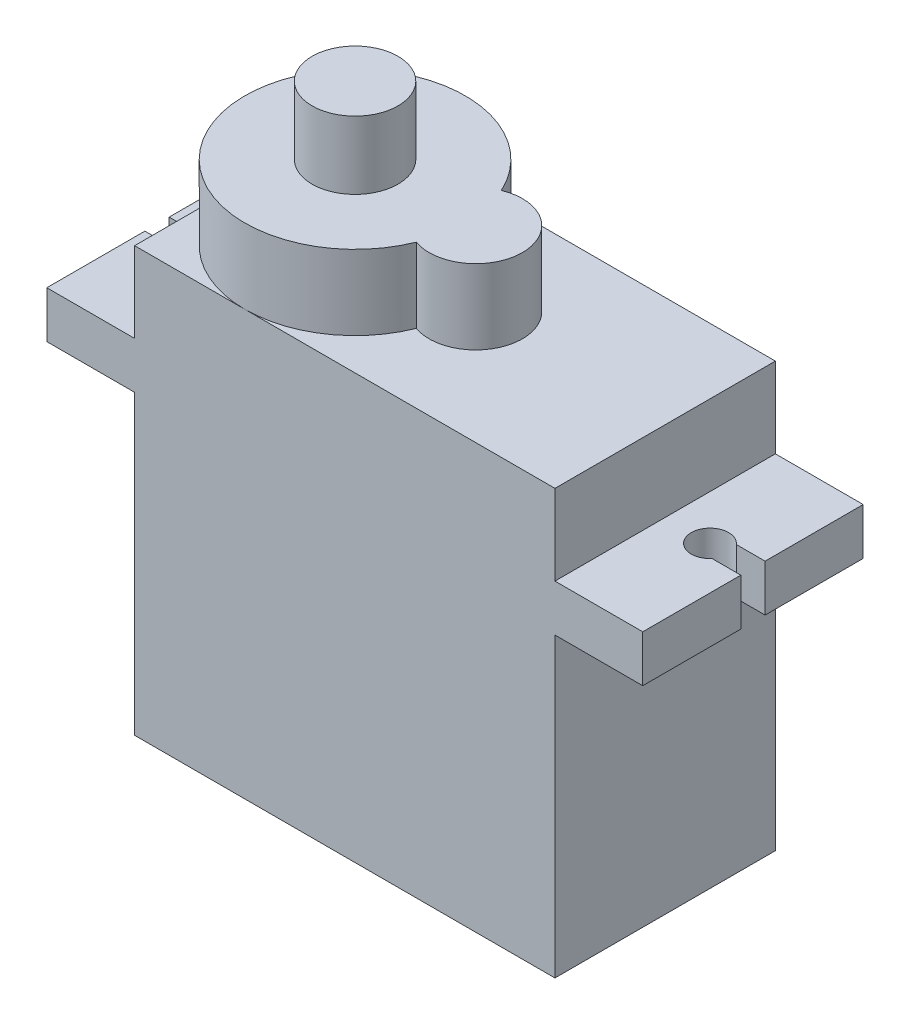
ISO-10303-21;
HEADER;
FILE_DESCRIPTION(('STEP AP214'),'2;1');
FILE_NAME('part.step','',(''),(''),'','','');
FILE_SCHEMA(('AUTOMOTIVE_DESIGN { 1 0 10303 214 1 1 1 1 }'));
ENDSEC;
DATA;
#1=APPLICATION_CONTEXT('core data for automotive mechanical design processes');
#2=APPLICATION_PROTOCOL_DEFINITION('international standard','automotive_design',2000,#1);
#3=PRODUCT_CONTEXT('',#1,'mechanical');
#4=PRODUCT('Part','Part','',(#3));
#5=PRODUCT_RELATED_PRODUCT_CATEGORY('part','',(#4));
#6=PRODUCT_DEFINITION_FORMATION('','',#4);
#7=PRODUCT_DEFINITION_CONTEXT('part definition',#1,'design');
#8=PRODUCT_DEFINITION('design','',#6,#7);
#9=PRODUCT_DEFINITION_SHAPE('','',#8);
#10=(LENGTH_UNIT() NAMED_UNIT(*) SI_UNIT(.MILLI.,.METRE.));
#11=(NAMED_UNIT(*) PLANE_ANGLE_UNIT() SI_UNIT($,.RADIAN.));
#12=(NAMED_UNIT(*) SI_UNIT($,.STERADIAN.) SOLID_ANGLE_UNIT());
#13=UNCERTAINTY_MEASURE_WITH_UNIT(LENGTH_MEASURE(1.E-05),#10,'distance_accuracy_value','');
#14=(GEOMETRIC_REPRESENTATION_CONTEXT(3) GLOBAL_UNCERTAINTY_ASSIGNED_CONTEXT((#13)) GLOBAL_UNIT_ASSIGNED_CONTEXT((#10,
#11,#12)) REPRESENTATION_CONTEXT('',''));
#15=CARTESIAN_POINT('',(0.,0.,0.));
#16=DIRECTION('',(0.,0.,1.));
#17=DIRECTION('',(1.,0.,0.));
#18=AXIS2_PLACEMENT_3D('',#15,#16,#17);
#19=CARTESIAN_POINT('',(-22.5,0.,11.8));
#20=DIRECTION('',(-1.,0.,0.));
#21=DIRECTION('',(0.,0.,1.));
#22=AXIS2_PLACEMENT_3D('',#19,#20,#21);
#23=PLANE('',#22);
#24=DIRECTION('',(0.,1.,0.));
#25=VECTOR('',#24,1.);
#26=CARTESIAN_POINT('',(-22.5,0.,0.));
#27=LINE('',#26,#25);
#28=CARTESIAN_POINT('',(-22.5,0.,0.));
#29=VERTEX_POINT('',#28);
#30=CARTESIAN_POINT('',(-22.5,15.9,0.));
#31=VERTEX_POINT('',#30);
#32=EDGE_CURVE('E358',#29,#31,#27,.T.);
#33=ORIENTED_EDGE('',*,*,#32,.F.);
#34=DIRECTION('',(0.,0.,-1.));
#35=VECTOR('',#34,1.);
#36=CARTESIAN_POINT('',(-22.5,0.,11.8));
#37=LINE('',#36,#35);
#38=CARTESIAN_POINT('',(-22.5,0.,11.8));
#39=VERTEX_POINT('',#38);
#40=EDGE_CURVE('E37',#39,#29,#37,.T.);
#41=ORIENTED_EDGE('',*,*,#40,.F.);
#42=DIRECTION('',(0.,1.,0.));
#43=VECTOR('',#42,1.);
#44=CARTESIAN_POINT('',(-22.5,0.,11.8));
#45=LINE('',#44,#43);
#46=CARTESIAN_POINT('',(-22.5,15.9,11.8));
#47=VERTEX_POINT('',#46);
#48=EDGE_CURVE('E322',#39,#47,#45,.T.);
#49=ORIENTED_EDGE('',*,*,#48,.T.);
#50=DIRECTION('',(0.,0.,-1.));
#51=VECTOR('',#50,1.);
#52=CARTESIAN_POINT('',(-22.5,15.9,11.8));
#53=LINE('',#52,#51);
#54=EDGE_CURVE('E421',#47,#31,#53,.T.);
#55=ORIENTED_EDGE('',*,*,#54,.T.);
#56=EDGE_LOOP('',(#33,#41,#49,#55));
#57=FACE_BOUND('',#56,.T.);
#58=DIRECTION('',(0.,-1.,0.));
#59=VECTOR('',#58,1.);
#60=CARTESIAN_POINT('',(-22.5,4.5,4.1));
#61=LINE('',#60,#59);
#62=CARTESIAN_POINT('',(-22.5,5.7,4.1));
#63=VERTEX_POINT('',#62);
#64=CARTESIAN_POINT('',(-22.5,4.5,4.1));
#65=VERTEX_POINT('',#64);
#66=EDGE_CURVE('E802',#63,#65,#61,.T.);
#67=ORIENTED_EDGE('',*,*,#66,.F.);
#68=DIRECTION('',(0.,0.,-1.));
#69=VECTOR('',#68,1.);
#70=CARTESIAN_POINT('',(-22.5,5.7,4.1));
#71=LINE('',#70,#69);
#72=CARTESIAN_POINT('',(-22.5,5.7,7.7));
#73=VERTEX_POINT('',#72);
#74=EDGE_CURVE('E241',#73,#63,#71,.T.);
#75=ORIENTED_EDGE('',*,*,#74,.F.);
#76=DIRECTION('',(0.,1.,0.));
#77=VECTOR('',#76,1.);
#78=CARTESIAN_POINT('',(-22.5,4.5,7.7));
#79=LINE('',#78,#77);
#80=CARTESIAN_POINT('',(-22.5,4.5,7.7));
#81=VERTEX_POINT('',#80);
#82=EDGE_CURVE('E237',#81,#73,#79,.T.);
#83=ORIENTED_EDGE('',*,*,#82,.F.);
#84=DIRECTION('',(0.,0.,1.));
#85=VECTOR('',#84,1.);
#86=CARTESIAN_POINT('',(-22.5,4.5,4.1));
#87=LINE('',#86,#85);
#88=EDGE_CURVE('E799',#65,#81,#87,.T.);
#89=ORIENTED_EDGE('',*,*,#88,.F.);
#90=EDGE_LOOP('',(#67,#75,#83,#89));
#91=FACE_BOUND('',#90,.T.);
#92=ADVANCED_FACE('F33',(#57,#91),#23,.T.);
#93=CARTESIAN_POINT('',(4.7,18.4,11.8));
#94=DIRECTION('',(1.,0.,0.));
#95=DIRECTION('',(0.,0.,-1.));
#96=AXIS2_PLACEMENT_3D('',#93,#94,#95);
#97=PLANE('',#96);
#98=DIRECTION('',(0.,1.,0.));
#99=VECTOR('',#98,1.);
#100=CARTESIAN_POINT('',(4.7,-0.00100000000002876,6.55));
#101=LINE('',#100,#99);
#102=CARTESIAN_POINT('',(4.7,15.9,6.55));
#103=VERTEX_POINT('',#102);
#104=CARTESIAN_POINT('',(4.7,18.4,6.55));
#105=VERTEX_POINT('',#104);
#106=EDGE_CURVE('E252',#103,#105,#101,.T.);
#107=ORIENTED_EDGE('',*,*,#106,.T.);
#108=DIRECTION('',(0.,0.,-1.));
#109=VECTOR('',#108,1.);
#110=CARTESIAN_POINT('',(4.7,18.4,11.8));
#111=LINE('',#110,#109);
#112=CARTESIAN_POINT('',(4.7,18.4,11.8));
#113=VERTEX_POINT('',#112);
#114=EDGE_CURVE('E399',#113,#105,#111,.T.);
#115=ORIENTED_EDGE('',*,*,#114,.F.);
#116=DIRECTION('',(0.,-1.,0.));
#117=VECTOR('',#116,1.);
#118=CARTESIAN_POINT('',(4.7,18.4,11.8));
#119=LINE('',#118,#117);
#120=CARTESIAN_POINT('',(4.7,15.9,11.8));
#121=VERTEX_POINT('',#120);
#122=EDGE_CURVE('E347',#113,#121,#119,.T.);
#123=ORIENTED_EDGE('',*,*,#122,.T.);
#124=DIRECTION('',(0.,0.,-1.));
#125=VECTOR('',#124,1.);
#126=CARTESIAN_POINT('',(4.7,15.9,11.8));
#127=LINE('',#126,#125);
#128=EDGE_CURVE('E395',#121,#103,#127,.T.);
#129=ORIENTED_EDGE('',*,*,#128,.T.);
#130=EDGE_LOOP('',(#107,#115,#123,#129));
#131=FACE_BOUND('',#130,.T.);
#132=ADVANCED_FACE('F493',(#131),#97,.T.);
#133=CARTESIAN_POINT('',(-27.2,15.9,11.8));
#134=DIRECTION('',(-1.,0.,0.));
#135=DIRECTION('',(0.,0.,1.));
#136=AXIS2_PLACEMENT_3D('',#133,#134,#135);
#137=PLANE('',#136);
#138=DIRECTION('',(0.,1.,0.));
#139=VECTOR('',#138,1.);
#140=CARTESIAN_POINT('',(-27.2,-0.00100000000000447,5.25));
#141=LINE('',#140,#139);
#142=CARTESIAN_POINT('',(-27.2,15.9,5.25));
#143=VERTEX_POINT('',#142);
#144=CARTESIAN_POINT('',(-27.2,18.4,5.25));
#145=VERTEX_POINT('',#144);
#146=EDGE_CURVE('E246',#143,#145,#141,.T.);
#147=ORIENTED_EDGE('',*,*,#146,.T.);
#148=DIRECTION('',(0.,0.,-1.));
#149=VECTOR('',#148,1.);
#150=CARTESIAN_POINT('',(-27.2,18.4,11.8));
#151=LINE('',#150,#149);
#152=CARTESIAN_POINT('',(-27.2,18.4,0.));
#153=VERTEX_POINT('',#152);
#154=EDGE_CURVE('E417',#145,#153,#151,.T.);
#155=ORIENTED_EDGE('',*,*,#154,.T.);
#156=DIRECTION('',(0.,1.,0.));
#157=VECTOR('',#156,1.);
#158=CARTESIAN_POINT('',(-27.2,15.9,0.));
#159=LINE('',#158,#157);
#160=CARTESIAN_POINT('',(-27.2,15.9,0.));
#161=VERTEX_POINT('',#160);
#162=EDGE_CURVE('E364',#161,#153,#159,.T.);
#163=ORIENTED_EDGE('',*,*,#162,.F.);
#164=DIRECTION('',(0.,0.,-1.));
#165=VECTOR('',#164,1.);
#166=CARTESIAN_POINT('',(-27.2,15.9,11.8));
#167=LINE('',#166,#165);
#168=EDGE_CURVE('E420',#143,#161,#167,.T.);
#169=ORIENTED_EDGE('',*,*,#168,.F.);
#170=EDGE_LOOP('',(#147,#155,#163,#169));
#171=FACE_BOUND('',#170,.T.);
#172=ADVANCED_FACE('F449',(#171),#137,.T.);
#173=CARTESIAN_POINT('',(-16.6,26.7,5.9));
#174=DIRECTION('',(0.,-1.,0.));
#175=DIRECTION('',(0.,0.,-1.));
#176=AXIS2_PLACEMENT_3D('',#173,#174,#175);
#177=CYLINDRICAL_SURFACE('',#176,5.9);
#178=DIRECTION('',(0.,-1.,0.));
#179=VECTOR('',#178,1.);
#180=CARTESIAN_POINT('',(-11.1248588482981,24.7,8.09836970706487));
#181=LINE('',#180,#179);
#182=CARTESIAN_POINT('',(-11.1248588482981,26.7,8.09836970706486));
#183=VERTEX_POINT('',#182);
#184=CARTESIAN_POINT('',(-11.1248588482981,22.7,8.09836970706486));
#185=VERTEX_POINT('',#184);
#186=EDGE_CURVE('E308',#183,#185,#181,.T.);
#187=ORIENTED_EDGE('',*,*,#186,.F.);
#188=CARTESIAN_POINT('',(-16.6,26.7,5.9));
#189=DIRECTION('',(0.,1.,0.));
#190=DIRECTION('',(0.,0.,1.));
#191=AXIS2_PLACEMENT_3D('',#188,#189,#190);
#192=CIRCLE('',#191,5.9);
#193=CARTESIAN_POINT('',(-11.2447898021573,26.7,3.42376823844743));
#194=VERTEX_POINT('',#193);
#195=EDGE_CURVE('E311',#194,#183,#192,.T.);
#196=ORIENTED_EDGE('',*,*,#195,.F.);
#197=DIRECTION('',(0.,-1.,0.));
#198=VECTOR('',#197,1.);
#199=CARTESIAN_POINT('',(-11.2447898021573,24.7,3.42376823844743));
#200=LINE('',#199,#198);
#201=CARTESIAN_POINT('',(-11.2447898021573,22.7,3.42376823844743));
#202=VERTEX_POINT('',#201);
#203=EDGE_CURVE('E304',#202,#194,#200,.F.);
#204=ORIENTED_EDGE('',*,*,#203,.F.);
#205=CARTESIAN_POINT('',(-16.6,22.7,5.9));
#206=DIRECTION('',(0.,1.,0.));
#207=DIRECTION('',(0.,0.,1.));
#208=AXIS2_PLACEMENT_3D('',#205,#206,#207);
#209=CIRCLE('',#208,5.9);
#210=CARTESIAN_POINT('',(-16.6,22.7,0.));
#211=VERTEX_POINT('',#210);
#212=EDGE_CURVE('E310',#202,#211,#209,.T.);
#213=ORIENTED_EDGE('',*,*,#212,.T.);
#214=CARTESIAN_POINT('',(-22.5,22.7,5.9));
#215=VERTEX_POINT('',#214);
#216=EDGE_CURVE('E42',#211,#215,#209,.T.);
#217=ORIENTED_EDGE('',*,*,#216,.T.);
#218=CARTESIAN_POINT('',(-16.6,22.7,11.8));
#219=VERTEX_POINT('',#218);
#220=EDGE_CURVE('E318',#215,#219,#209,.T.);
#221=ORIENTED_EDGE('',*,*,#220,.T.);
#222=EDGE_CURVE('E315',#219,#185,#209,.T.);
#223=ORIENTED_EDGE('',*,*,#222,.T.);
#224=EDGE_LOOP('',(#187,#196,#204,#213,#217,#221,#223));
#225=FACE_BOUND('',#224,.T.);
#226=ADVANCED_FACE('F496',(#225),#177,.T.);
#227=CARTESIAN_POINT('',(-22.5,22.7,11.8));
#228=DIRECTION('',(0.,1.,0.));
#229=DIRECTION('',(0.,0.,1.));
#230=AXIS2_PLACEMENT_3D('',#227,#228,#229);
#231=PLANE('',#230);
#232=ORIENTED_EDGE('',*,*,#212,.F.);
#233=CARTESIAN_POINT('',(-10.3,22.7,5.73836803749251));
#234=DIRECTION('',(0.,1.,0.));
#235=DIRECTION('',(0.,0.,1.));
#236=AXIS2_PLACEMENT_3D('',#233,#234,#235);
#237=CIRCLE('',#236,2.5);
#238=EDGE_CURVE('E300',#185,#202,#237,.T.);
#239=ORIENTED_EDGE('',*,*,#238,.F.);
#240=ORIENTED_EDGE('',*,*,#222,.F.);
#241=DIRECTION('',(1.,0.,0.));
#242=VECTOR('',#241,1.);
#243=CARTESIAN_POINT('',(-22.5,22.7,11.8));
#244=LINE('',#243,#242);
#245=CARTESIAN_POINT('',(0.,22.7,11.8));
#246=VERTEX_POINT('',#245);
#247=EDGE_CURVE('E338',#219,#246,#244,.T.);
#248=ORIENTED_EDGE('',*,*,#247,.T.);
#249=DIRECTION('',(0.,0.,-1.));
#250=VECTOR('',#249,1.);
#251=CARTESIAN_POINT('',(0.,22.7,11.8));
#252=LINE('',#251,#250);
#253=CARTESIAN_POINT('',(0.,22.7,0.));
#254=VERTEX_POINT('',#253);
#255=EDGE_CURVE('E405',#246,#254,#252,.T.);
#256=ORIENTED_EDGE('',*,*,#255,.T.);
#257=DIRECTION('',(1.,0.,0.));
#258=VECTOR('',#257,1.);
#259=CARTESIAN_POINT('',(-22.5,22.7,0.));
#260=LINE('',#259,#258);
#261=EDGE_CURVE('E373',#211,#254,#260,.T.);
#262=ORIENTED_EDGE('',*,*,#261,.F.);
#263=EDGE_LOOP('',(#232,#239,#240,#248,#256,#262));
#264=FACE_BOUND('',#263,.T.);
#265=ADVANCED_FACE('F469',(#264),#231,.T.);
#266=ORIENTED_EDGE('',*,*,#216,.F.);
#267=CARTESIAN_POINT('',(-22.5,22.7,0.));
#268=VERTEX_POINT('',#267);
#269=EDGE_CURVE('E374',#268,#211,#260,.T.);
#270=ORIENTED_EDGE('',*,*,#269,.F.);
#271=DIRECTION('',(0.,0.,-1.));
#272=VECTOR('',#271,1.);
#273=CARTESIAN_POINT('',(-22.5,22.7,11.8));
#274=LINE('',#273,#272);
#275=EDGE_CURVE('E411',#215,#268,#274,.T.);
#276=ORIENTED_EDGE('',*,*,#275,.F.);
#277=EDGE_LOOP('',(#266,#270,#276));
#278=FACE_BOUND('',#277,.T.);
#279=ADVANCED_FACE('F463',(#278),#231,.T.);
#280=CARTESIAN_POINT('',(0.,0.,11.8));
#281=DIRECTION('',(0.,-1.,0.));
#282=DIRECTION('',(1.,0.,0.));
#283=AXIS2_PLACEMENT_3D('',#280,#281,#282);
#284=PLANE('',#283);
#285=DIRECTION('',(-1.,0.,0.));
#286=VECTOR('',#285,1.);
#287=CARTESIAN_POINT('',(0.,0.,0.));
#288=LINE('',#287,#286);
#289=CARTESIAN_POINT('',(0.,0.,0.));
#290=VERTEX_POINT('',#289);
#291=EDGE_CURVE('E314',#290,#29,#288,.T.);
#292=ORIENTED_EDGE('',*,*,#291,.F.);
#293=DIRECTION('',(0.,0.,-1.));
#294=VECTOR('',#293,1.);
#295=CARTESIAN_POINT('',(0.,0.,11.8));
#296=LINE('',#295,#294);
#297=CARTESIAN_POINT('',(0.,0.,11.8));
#298=VERTEX_POINT('',#297);
#299=EDGE_CURVE('E391',#298,#290,#296,.T.);
#300=ORIENTED_EDGE('',*,*,#299,.F.);
#301=DIRECTION('',(-1.,0.,0.));
#302=VECTOR('',#301,1.);
#303=CARTESIAN_POINT('',(0.,0.,11.8));
#304=LINE('',#303,#302);
#305=EDGE_CURVE('E319',#298,#39,#304,.T.);
#306=ORIENTED_EDGE('',*,*,#305,.T.);
#307=ORIENTED_EDGE('',*,*,#40,.T.);
#308=EDGE_LOOP('',(#292,#300,#306,#307));
#309=FACE_BOUND('',#308,.T.);
#310=ADVANCED_FACE('F35',(#309),#284,.T.);
#311=CARTESIAN_POINT('',(0.,15.9,11.8));
#312=DIRECTION('',(1.,0.,0.));
#313=DIRECTION('',(0.,1.,0.));
#314=AXIS2_PLACEMENT_3D('',#311,#312,#313);
#315=PLANE('',#314);
#316=DIRECTION('',(0.,-1.,0.));
#317=VECTOR('',#316,1.);
#318=CARTESIAN_POINT('',(0.,15.9,0.));
#319=LINE('',#318,#317);
#320=CARTESIAN_POINT('',(0.,15.9,0.));
#321=VERTEX_POINT('',#320);
#322=EDGE_CURVE('E323',#321,#290,#319,.T.);
#323=ORIENTED_EDGE('',*,*,#322,.F.);
#324=DIRECTION('',(0.,0.,-1.));
#325=VECTOR('',#324,1.);
#326=CARTESIAN_POINT('',(0.,15.9,11.8));
#327=LINE('',#326,#325);
#328=CARTESIAN_POINT('',(0.,15.9,11.8));
#329=VERTEX_POINT('',#328);
#330=EDGE_CURVE('E393',#329,#321,#327,.T.);
#331=ORIENTED_EDGE('',*,*,#330,.F.);
#332=DIRECTION('',(0.,-1.,0.));
#333=VECTOR('',#332,1.);
#334=CARTESIAN_POINT('',(0.,15.9,11.8));
#335=LINE('',#334,#333);
#336=EDGE_CURVE('E353',#329,#298,#335,.T.);
#337=ORIENTED_EDGE('',*,*,#336,.T.);
#338=ORIENTED_EDGE('',*,*,#299,.T.);
#339=EDGE_LOOP('',(#323,#331,#337,#338));
#340=FACE_BOUND('',#339,.T.);
#341=ADVANCED_FACE('F435',(#340),#315,.T.);
#342=CARTESIAN_POINT('',(4.7,15.9,11.8));
#343=DIRECTION('',(0.,-1.,0.));
#344=DIRECTION('',(1.,0.,0.));
#345=AXIS2_PLACEMENT_3D('',#342,#343,#344);
#346=PLANE('',#345);
#347=DIRECTION('',(1.,0.,0.));
#348=VECTOR('',#347,1.);
#349=CARTESIAN_POINT('',(6.66188740729014,15.9,6.55));
#350=LINE('',#349,#348);
#351=CARTESIAN_POINT('',(3.15993420767853,15.9,6.55));
#352=VERTEX_POINT('',#351);
#353=EDGE_CURVE('E259',#352,#103,#350,.T.);
#354=ORIENTED_EDGE('',*,*,#353,.T.);
#355=ORIENTED_EDGE('',*,*,#128,.F.);
#356=DIRECTION('',(-1.,0.,0.));
#357=VECTOR('',#356,1.);
#358=CARTESIAN_POINT('',(4.7,15.9,11.8));
#359=LINE('',#358,#357);
#360=EDGE_CURVE('E350',#121,#329,#359,.T.);
#361=ORIENTED_EDGE('',*,*,#360,.T.);
#362=ORIENTED_EDGE('',*,*,#330,.T.);
#363=DIRECTION('',(-1.,0.,0.));
#364=VECTOR('',#363,1.);
#365=CARTESIAN_POINT('',(4.7,15.9,0.));
#366=LINE('',#365,#364);
#367=CARTESIAN_POINT('',(4.7,15.9,0.));
#368=VERTEX_POINT('',#367);
#369=EDGE_CURVE('E386',#368,#321,#366,.T.);
#370=ORIENTED_EDGE('',*,*,#369,.F.);
#371=CARTESIAN_POINT('',(4.7,15.9,5.25));
#372=VERTEX_POINT('',#371);
#373=EDGE_CURVE('E398',#372,#368,#127,.T.);
#374=ORIENTED_EDGE('',*,*,#373,.F.);
#375=DIRECTION('',(-1.,0.,0.));
#376=VECTOR('',#375,1.);
#377=CARTESIAN_POINT('',(6.66188740729014,15.9,5.25));
#378=LINE('',#377,#376);
#379=CARTESIAN_POINT('',(3.15993420767853,15.9,5.25));
#380=VERTEX_POINT('',#379);
#381=EDGE_CURVE('E272',#372,#380,#378,.T.);
#382=ORIENTED_EDGE('',*,*,#381,.T.);
#383=CARTESIAN_POINT('',(2.4,15.9,5.9));
#384=DIRECTION('',(0.,-1.,0.));
#385=DIRECTION('',(1.,0.,0.));
#386=AXIS2_PLACEMENT_3D('',#383,#384,#385);
#387=CIRCLE('',#386,1.);
#388=EDGE_CURVE('E256',#380,#352,#387,.F.);
#389=ORIENTED_EDGE('',*,*,#388,.T.);
#390=EDGE_LOOP('',(#354,#355,#361,#362,#370,#374,#382,#389));
#391=FACE_BOUND('',#390,.T.);
#392=ADVANCED_FACE('F490',(#391),#346,.T.);
#393=DIRECTION('',(0.,-1.,0.));
#394=VECTOR('',#393,1.);
#395=CARTESIAN_POINT('',(4.7,-0.00100000000002876,5.25));
#396=LINE('',#395,#394);
#397=CARTESIAN_POINT('',(4.7,18.4,5.25));
#398=VERTEX_POINT('',#397);
#399=EDGE_CURVE('E58',#398,#372,#396,.T.);
#400=ORIENTED_EDGE('',*,*,#399,.T.);
#401=ORIENTED_EDGE('',*,*,#373,.T.);
#402=DIRECTION('',(0.,-1.,0.));
#403=VECTOR('',#402,1.);
#404=CARTESIAN_POINT('',(4.7,18.4,0.));
#405=LINE('',#404,#403);
#406=CARTESIAN_POINT('',(4.7,18.4,0.));
#407=VERTEX_POINT('',#406);
#408=EDGE_CURVE('E383',#407,#368,#405,.T.);
#409=ORIENTED_EDGE('',*,*,#408,.F.);
#410=EDGE_CURVE('E402',#398,#407,#111,.T.);
#411=ORIENTED_EDGE('',*,*,#410,.F.);
#412=EDGE_LOOP('',(#400,#401,#409,#411));
#413=FACE_BOUND('',#412,.T.);
#414=ADVANCED_FACE('F487',(#413),#97,.T.);
#415=CARTESIAN_POINT('',(0.,18.4,11.8));
#416=DIRECTION('',(0.,1.,0.));
#417=DIRECTION('',(-1.,0.,0.));
#418=AXIS2_PLACEMENT_3D('',#415,#416,#417);
#419=PLANE('',#418);
#420=DIRECTION('',(1.,0.,0.));
#421=VECTOR('',#420,1.);
#422=CARTESIAN_POINT('',(6.66188740729014,18.4,6.55));
#423=LINE('',#422,#421);
#424=CARTESIAN_POINT('',(3.15993420767854,18.4,6.55));
#425=VERTEX_POINT('',#424);
#426=EDGE_CURVE('E267',#425,#105,#423,.T.);
#427=ORIENTED_EDGE('',*,*,#426,.F.);
#428=CARTESIAN_POINT('',(2.4,18.4,5.9));
#429=DIRECTION('',(0.,1.,0.));
#430=DIRECTION('',(1.,0.,0.));
#431=AXIS2_PLACEMENT_3D('',#428,#429,#430);
#432=CIRCLE('',#431,1.);
#433=CARTESIAN_POINT('',(3.15993420767853,18.4,5.25));
#434=VERTEX_POINT('',#433);
#435=EDGE_CURVE('E264',#434,#425,#432,.T.);
#436=ORIENTED_EDGE('',*,*,#435,.F.);
#437=DIRECTION('',(-1.,0.,0.));
#438=VECTOR('',#437,1.);
#439=CARTESIAN_POINT('',(6.66188740729014,18.4,5.25));
#440=LINE('',#439,#438);
#441=EDGE_CURVE('E262',#398,#434,#440,.T.);
#442=ORIENTED_EDGE('',*,*,#441,.F.);
#443=ORIENTED_EDGE('',*,*,#410,.T.);
#444=DIRECTION('',(1.,0.,0.));
#445=VECTOR('',#444,1.);
#446=CARTESIAN_POINT('',(0.,18.4,0.));
#447=LINE('',#446,#445);
#448=CARTESIAN_POINT('',(0.,18.4,0.));
#449=VERTEX_POINT('',#448);
#450=EDGE_CURVE('E380',#449,#407,#447,.T.);
#451=ORIENTED_EDGE('',*,*,#450,.F.);
#452=DIRECTION('',(0.,0.,-1.));
#453=VECTOR('',#452,1.);
#454=CARTESIAN_POINT('',(0.,18.4,11.8));
#455=LINE('',#454,#453);
#456=CARTESIAN_POINT('',(0.,18.4,11.8));
#457=VERTEX_POINT('',#456);
#458=EDGE_CURVE('E403',#457,#449,#455,.T.);
#459=ORIENTED_EDGE('',*,*,#458,.F.);
#460=DIRECTION('',(1.,0.,0.));
#461=VECTOR('',#460,1.);
#462=CARTESIAN_POINT('',(0.,18.4,11.8));
#463=LINE('',#462,#461);
#464=EDGE_CURVE('E344',#457,#113,#463,.T.);
#465=ORIENTED_EDGE('',*,*,#464,.T.);
#466=ORIENTED_EDGE('',*,*,#114,.T.);
#467=EDGE_LOOP('',(#427,#436,#442,#443,#451,#459,#465,#466));
#468=FACE_BOUND('',#467,.T.);
#469=ADVANCED_FACE('F482',(#468),#419,.T.);
#470=CARTESIAN_POINT('',(0.,22.7,11.8));
#471=DIRECTION('',(1.,0.,0.));
#472=DIRECTION('',(0.,1.,0.));
#473=AXIS2_PLACEMENT_3D('',#470,#471,#472);
#474=PLANE('',#473);
#475=DIRECTION('',(0.,-1.,0.));
#476=VECTOR('',#475,1.);
#477=CARTESIAN_POINT('',(0.,22.7,0.));
#478=LINE('',#477,#476);
#479=EDGE_CURVE('E377',#254,#449,#478,.T.);
#480=ORIENTED_EDGE('',*,*,#479,.F.);
#481=ORIENTED_EDGE('',*,*,#255,.F.);
#482=DIRECTION('',(0.,-1.,0.));
#483=VECTOR('',#482,1.);
#484=CARTESIAN_POINT('',(0.,22.7,11.8));
#485=LINE('',#484,#483);
#486=EDGE_CURVE('E341',#246,#457,#485,.T.);
#487=ORIENTED_EDGE('',*,*,#486,.T.);
#488=ORIENTED_EDGE('',*,*,#458,.T.);
#489=EDGE_LOOP('',(#480,#481,#487,#488));
#490=FACE_BOUND('',#489,.T.);
#491=ADVANCED_FACE('F477',(#490),#474,.T.);
#492=ORIENTED_EDGE('',*,*,#220,.F.);
#493=CARTESIAN_POINT('',(-22.5,22.7,11.8));
#494=VERTEX_POINT('',#493);
#495=EDGE_CURVE('E408',#494,#215,#274,.T.);
#496=ORIENTED_EDGE('',*,*,#495,.F.);
#497=EDGE_CURVE('E339',#494,#219,#244,.T.);
#498=ORIENTED_EDGE('',*,*,#497,.T.);
#499=EDGE_LOOP('',(#492,#496,#498));
#500=FACE_BOUND('',#499,.T.);
#501=ADVANCED_FACE('F498',(#500),#231,.T.);
#502=CARTESIAN_POINT('',(-22.5,18.4,11.8));
#503=DIRECTION('',(-1.,0.,0.));
#504=DIRECTION('',(0.,0.,1.));
#505=AXIS2_PLACEMENT_3D('',#502,#503,#504);
#506=PLANE('',#505);
#507=DIRECTION('',(0.,1.,0.));
#508=VECTOR('',#507,1.);
#509=CARTESIAN_POINT('',(-22.5,18.4,0.));
#510=LINE('',#509,#508);
#511=CARTESIAN_POINT('',(-22.5,18.4,0.));
#512=VERTEX_POINT('',#511);
#513=EDGE_CURVE('E370',#512,#268,#510,.T.);
#514=ORIENTED_EDGE('',*,*,#513,.F.);
#515=DIRECTION('',(0.,0.,-1.));
#516=VECTOR('',#515,1.);
#517=CARTESIAN_POINT('',(-22.5,18.4,11.8));
#518=LINE('',#517,#516);
#519=CARTESIAN_POINT('',(-22.5,18.4,11.8));
#520=VERTEX_POINT('',#519);
#521=EDGE_CURVE('E412',#520,#512,#518,.T.);
#522=ORIENTED_EDGE('',*,*,#521,.F.);
#523=DIRECTION('',(0.,1.,0.));
#524=VECTOR('',#523,1.);
#525=CARTESIAN_POINT('',(-22.5,18.4,11.8));
#526=LINE('',#525,#524);
#527=EDGE_CURVE('E335',#520,#494,#526,.T.);
#528=ORIENTED_EDGE('',*,*,#527,.T.);
#529=ORIENTED_EDGE('',*,*,#495,.T.);
#530=ORIENTED_EDGE('',*,*,#275,.T.);
#531=EDGE_LOOP('',(#514,#522,#528,#529,#530));
#532=FACE_BOUND('',#531,.T.);
#533=ADVANCED_FACE('F457',(#532),#506,.T.);
#534=CARTESIAN_POINT('',(-27.2,18.4,11.8));
#535=DIRECTION('',(0.,1.,0.));
#536=DIRECTION('',(-1.,0.,0.));
#537=AXIS2_PLACEMENT_3D('',#534,#535,#536);
#538=PLANE('',#537);
#539=DIRECTION('',(-1.,0.,0.));
#540=VECTOR('',#539,1.);
#541=CARTESIAN_POINT('',(-29.1618874072901,18.4,5.25));
#542=LINE('',#541,#540);
#543=CARTESIAN_POINT('',(-25.6599342076785,18.4,5.25));
#544=VERTEX_POINT('',#543);
#545=EDGE_CURVE('E291',#544,#145,#542,.T.);
#546=ORIENTED_EDGE('',*,*,#545,.F.);
#547=CARTESIAN_POINT('',(-24.9,18.4,5.9));
#548=DIRECTION('',(0.,1.,0.));
#549=DIRECTION('',(-1.,0.,0.));
#550=AXIS2_PLACEMENT_3D('',#547,#548,#549);
#551=CIRCLE('',#550,1.);
#552=CARTESIAN_POINT('',(-25.6599342076785,18.4,6.55));
#553=VERTEX_POINT('',#552);
#554=EDGE_CURVE('E288',#553,#544,#551,.T.);
#555=ORIENTED_EDGE('',*,*,#554,.F.);
#556=DIRECTION('',(1.,0.,0.));
#557=VECTOR('',#556,1.);
#558=CARTESIAN_POINT('',(-29.1618874072901,18.4,6.55));
#559=LINE('',#558,#557);
#560=CARTESIAN_POINT('',(-27.2,18.4,6.55));
#561=VERTEX_POINT('',#560);
#562=EDGE_CURVE('E285',#561,#553,#559,.T.);
#563=ORIENTED_EDGE('',*,*,#562,.F.);
#564=CARTESIAN_POINT('',(-27.2,18.4,11.8));
#565=VERTEX_POINT('',#564);
#566=EDGE_CURVE('E414',#565,#561,#151,.T.);
#567=ORIENTED_EDGE('',*,*,#566,.F.);
#568=DIRECTION('',(1.,0.,0.));
#569=VECTOR('',#568,1.);
#570=CARTESIAN_POINT('',(-27.2,18.4,11.8));
#571=LINE('',#570,#569);
#572=EDGE_CURVE('E332',#565,#520,#571,.T.);
#573=ORIENTED_EDGE('',*,*,#572,.T.);
#574=ORIENTED_EDGE('',*,*,#521,.T.);
#575=DIRECTION('',(1.,0.,0.));
#576=VECTOR('',#575,1.);
#577=CARTESIAN_POINT('',(-27.2,18.4,0.));
#578=LINE('',#577,#576);
#579=EDGE_CURVE('E367',#153,#512,#578,.T.);
#580=ORIENTED_EDGE('',*,*,#579,.F.);
#581=ORIENTED_EDGE('',*,*,#154,.F.);
#582=EDGE_LOOP('',(#546,#555,#563,#567,#573,#574,#580,#581));
#583=FACE_BOUND('',#582,.T.);
#584=ADVANCED_FACE('F453',(#583),#538,.T.);
#585=DIRECTION('',(0.,-1.,0.));
#586=VECTOR('',#585,1.);
#587=CARTESIAN_POINT('',(-27.2,-0.00100000000000447,6.55));
#588=LINE('',#587,#586);
#589=CARTESIAN_POINT('',(-27.2,15.9,6.55));
#590=VERTEX_POINT('',#589);
#591=EDGE_CURVE('E243',#561,#590,#588,.T.);
#592=ORIENTED_EDGE('',*,*,#591,.T.);
#593=CARTESIAN_POINT('',(-27.2,15.9,11.8));
#594=VERTEX_POINT('',#593);
#595=EDGE_CURVE('E418',#594,#590,#167,.T.);
#596=ORIENTED_EDGE('',*,*,#595,.F.);
#597=DIRECTION('',(0.,1.,0.));
#598=VECTOR('',#597,1.);
#599=CARTESIAN_POINT('',(-27.2,15.9,11.8));
#600=LINE('',#599,#598);
#601=EDGE_CURVE('E329',#594,#565,#600,.T.);
#602=ORIENTED_EDGE('',*,*,#601,.T.);
#603=ORIENTED_EDGE('',*,*,#566,.T.);
#604=EDGE_LOOP('',(#592,#596,#602,#603));
#605=FACE_BOUND('',#604,.T.);
#606=ADVANCED_FACE('F500',(#605),#137,.T.);
#607=CARTESIAN_POINT('',(-22.5,15.9,11.8));
#608=DIRECTION('',(0.,-1.,0.));
#609=DIRECTION('',(1.,0.,0.));
#610=AXIS2_PLACEMENT_3D('',#607,#608,#609);
#611=PLANE('',#610);
#612=DIRECTION('',(-1.,0.,0.));
#613=VECTOR('',#612,1.);
#614=CARTESIAN_POINT('',(-29.1618874072901,15.9,5.25));
#615=LINE('',#614,#613);
#616=CARTESIAN_POINT('',(-25.6599342076785,15.9,5.25));
#617=VERTEX_POINT('',#616);
#618=EDGE_CURVE('E282',#617,#143,#615,.T.);
#619=ORIENTED_EDGE('',*,*,#618,.T.);
#620=ORIENTED_EDGE('',*,*,#168,.T.);
#621=DIRECTION('',(-1.,0.,0.));
#622=VECTOR('',#621,1.);
#623=CARTESIAN_POINT('',(-22.5,15.9,0.));
#624=LINE('',#623,#622);
#625=EDGE_CURVE('E361',#31,#161,#624,.T.);
#626=ORIENTED_EDGE('',*,*,#625,.F.);
#627=ORIENTED_EDGE('',*,*,#54,.F.);
#628=DIRECTION('',(-1.,0.,0.));
#629=VECTOR('',#628,1.);
#630=CARTESIAN_POINT('',(-22.5,15.9,11.8));
#631=LINE('',#630,#629);
#632=EDGE_CURVE('E326',#47,#594,#631,.T.);
#633=ORIENTED_EDGE('',*,*,#632,.T.);
#634=ORIENTED_EDGE('',*,*,#595,.T.);
#635=DIRECTION('',(1.,0.,0.));
#636=VECTOR('',#635,1.);
#637=CARTESIAN_POINT('',(-29.1618874072901,15.9,6.55));
#638=LINE('',#637,#636);
#639=CARTESIAN_POINT('',(-25.6599342076785,15.9,6.55));
#640=VERTEX_POINT('',#639);
#641=EDGE_CURVE('E253',#590,#640,#638,.T.);
#642=ORIENTED_EDGE('',*,*,#641,.T.);
#643=CARTESIAN_POINT('',(-24.9,15.9,5.9));
#644=DIRECTION('',(0.,-1.,0.));
#645=DIRECTION('',(1.,0.,0.));
#646=AXIS2_PLACEMENT_3D('',#643,#644,#645);
#647=CIRCLE('',#646,1.);
#648=EDGE_CURVE('E279',#640,#617,#647,.F.);
#649=ORIENTED_EDGE('',*,*,#648,.T.);
#650=EDGE_LOOP('',(#619,#620,#626,#627,#633,#634,#642,#649));
#651=FACE_BOUND('',#650,.T.);
#652=ADVANCED_FACE('F444',(#651),#611,.T.);
#653=CARTESIAN_POINT('',(0.,0.,11.8));
#654=DIRECTION('',(0.,0.,-1.));
#655=DIRECTION('',(-1.,0.,0.));
#656=AXIS2_PLACEMENT_3D('',#653,#654,#655);
#657=PLANE('',#656);
#658=ORIENTED_EDGE('',*,*,#305,.F.);
#659=ORIENTED_EDGE('',*,*,#336,.F.);
#660=ORIENTED_EDGE('',*,*,#360,.F.);
#661=ORIENTED_EDGE('',*,*,#122,.F.);
#662=ORIENTED_EDGE('',*,*,#464,.F.);
#663=ORIENTED_EDGE('',*,*,#486,.F.);
#664=ORIENTED_EDGE('',*,*,#247,.F.);
#665=ORIENTED_EDGE('',*,*,#497,.F.);
#666=ORIENTED_EDGE('',*,*,#527,.F.);
#667=ORIENTED_EDGE('',*,*,#572,.F.);
#668=ORIENTED_EDGE('',*,*,#601,.F.);
#669=ORIENTED_EDGE('',*,*,#632,.F.);
#670=ORIENTED_EDGE('',*,*,#48,.F.);
#671=EDGE_LOOP('',(#658,#659,#660,#661,#662,#663,#664,#665,#666,#667,#668,#669,#670));
#672=FACE_BOUND('',#671,.T.);
#673=ADVANCED_FACE('F438',(#672),#657,.F.);
#674=CARTESIAN_POINT('',(0.,0.,0.));
#675=DIRECTION('',(0.,0.,-1.));
#676=DIRECTION('',(-1.,0.,0.));
#677=AXIS2_PLACEMENT_3D('',#674,#675,#676);
#678=PLANE('',#677);
#679=ORIENTED_EDGE('',*,*,#291,.T.);
#680=ORIENTED_EDGE('',*,*,#32,.T.);
#681=ORIENTED_EDGE('',*,*,#625,.T.);
#682=ORIENTED_EDGE('',*,*,#162,.T.);
#683=ORIENTED_EDGE('',*,*,#579,.T.);
#684=ORIENTED_EDGE('',*,*,#513,.T.);
#685=ORIENTED_EDGE('',*,*,#269,.T.);
#686=ORIENTED_EDGE('',*,*,#261,.T.);
#687=ORIENTED_EDGE('',*,*,#479,.T.);
#688=ORIENTED_EDGE('',*,*,#450,.T.);
#689=ORIENTED_EDGE('',*,*,#408,.T.);
#690=ORIENTED_EDGE('',*,*,#369,.T.);
#691=ORIENTED_EDGE('',*,*,#322,.T.);
#692=EDGE_LOOP('',(#679,#680,#681,#682,#683,#684,#685,#686,#687,#688,#689,#690,#691));
#693=FACE_BOUND('',#692,.T.);
#694=ADVANCED_FACE('F431',(#693),#678,.T.);
#695=CARTESIAN_POINT('',(-16.6,26.7,5.9));
#696=DIRECTION('',(0.,1.,0.));
#697=DIRECTION('',(0.,0.,1.));
#698=AXIS2_PLACEMENT_3D('',#695,#696,#697);
#699=PLANE('',#698);
#700=CARTESIAN_POINT('',(-16.6,26.7,5.9));
#701=DIRECTION('',(0.,1.,0.));
#702=DIRECTION('',(0.,0.,1.));
#703=AXIS2_PLACEMENT_3D('',#700,#701,#702);
#704=CIRCLE('',#703,2.3);
#705=CARTESIAN_POINT('',(-16.6,26.7,8.2));
#706=VERTEX_POINT('',#705);
#707=EDGE_CURVE('E11',#706,#706,#704,.T.);
#708=ORIENTED_EDGE('',*,*,#707,.F.);
#709=EDGE_LOOP('',(#708));
#710=FACE_BOUND('',#709,.T.);
#711=ORIENTED_EDGE('',*,*,#195,.T.);
#712=CARTESIAN_POINT('',(-10.3,26.7,5.73836803749251));
#713=DIRECTION('',(0.,1.,0.));
#714=DIRECTION('',(0.,0.,1.));
#715=AXIS2_PLACEMENT_3D('',#712,#713,#714);
#716=CIRCLE('',#715,2.5);
#717=EDGE_CURVE('E302',#183,#194,#716,.T.);
#718=ORIENTED_EDGE('',*,*,#717,.T.);
#719=EDGE_LOOP('',(#711,#718));
#720=FACE_BOUND('',#719,.T.);
#721=ADVANCED_FACE('F550',(#710,#720),#699,.T.);
#722=CARTESIAN_POINT('',(-10.3,26.7,5.73836803749251));
#723=DIRECTION('',(0.,-1.,0.));
#724=DIRECTION('',(0.,0.,-1.));
#725=AXIS2_PLACEMENT_3D('',#722,#723,#724);
#726=CYLINDRICAL_SURFACE('',#725,2.5);
#727=ORIENTED_EDGE('',*,*,#717,.F.);
#728=ORIENTED_EDGE('',*,*,#186,.T.);
#729=ORIENTED_EDGE('',*,*,#238,.T.);
#730=ORIENTED_EDGE('',*,*,#203,.T.);
#731=EDGE_LOOP('',(#727,#728,#729,#730));
#732=FACE_BOUND('',#731,.T.);
#733=ADVANCED_FACE('F557',(#732),#726,.T.);
#734=CARTESIAN_POINT('',(-16.6,30.33,5.9));
#735=DIRECTION('',(0.,-1.,0.));
#736=DIRECTION('',(0.,0.,-1.));
#737=AXIS2_PLACEMENT_3D('',#734,#735,#736);
#738=CYLINDRICAL_SURFACE('',#737,2.3);
#739=CARTESIAN_POINT('',(-16.6,30.33,5.9));
#740=DIRECTION('',(0.,1.,0.));
#741=DIRECTION('',(0.,0.,1.));
#742=AXIS2_PLACEMENT_3D('',#739,#740,#741);
#743=CIRCLE('',#742,2.3);
#744=CARTESIAN_POINT('',(-16.6,30.33,8.2));
#745=VERTEX_POINT('',#744);
#746=EDGE_CURVE('E275',#745,#745,#743,.T.);
#747=ORIENTED_EDGE('',*,*,#746,.F.);
#748=EDGE_LOOP('',(#747));
#749=FACE_BOUND('',#748,.T.);
#750=ORIENTED_EDGE('',*,*,#707,.T.);
#751=EDGE_LOOP('',(#750));
#752=FACE_BOUND('',#751,.T.);
#753=ADVANCED_FACE('F519',(#749,#752),#738,.T.);
#754=CARTESIAN_POINT('',(-16.6,30.33,5.9));
#755=DIRECTION('',(0.,1.,0.));
#756=DIRECTION('',(0.,0.,1.));
#757=AXIS2_PLACEMENT_3D('',#754,#755,#756);
#758=PLANE('',#757);
#759=ORIENTED_EDGE('',*,*,#746,.T.);
#760=EDGE_LOOP('',(#759));
#761=FACE_BOUND('',#760,.T.);
#762=ADVANCED_FACE('F512',(#761),#758,.T.);
#763=CARTESIAN_POINT('',(-29.1618874072901,-0.00100000000000447,5.25));
#764=DIRECTION('',(0.,0.,-1.));
#765=DIRECTION('',(-1.,0.,0.));
#766=AXIS2_PLACEMENT_3D('',#763,#764,#765);
#767=PLANE('',#766);
#768=ORIENTED_EDGE('',*,*,#618,.F.);
#769=DIRECTION('',(0.,1.,0.));
#770=VECTOR('',#769,1.);
#771=CARTESIAN_POINT('',(-25.6599342076785,-0.00100000000000794,5.25));
#772=LINE('',#771,#770);
#773=EDGE_CURVE('E294',#617,#544,#772,.T.);
#774=ORIENTED_EDGE('',*,*,#773,.T.);
#775=ORIENTED_EDGE('',*,*,#545,.T.);
#776=ORIENTED_EDGE('',*,*,#146,.F.);
#777=EDGE_LOOP('',(#768,#774,#775,#776));
#778=FACE_BOUND('',#777,.T.);
#779=ADVANCED_FACE('F510',(#778),#767,.F.);
#780=CARTESIAN_POINT('',(-24.9,-0.00100000000000794,5.9));
#781=DIRECTION('',(0.,1.,0.));
#782=DIRECTION('',(-1.,0.,0.));
#783=AXIS2_PLACEMENT_3D('',#780,#781,#782);
#784=CYLINDRICAL_SURFACE('',#783,1.);
#785=DIRECTION('',(0.,1.,0.));
#786=VECTOR('',#785,1.);
#787=CARTESIAN_POINT('',(-25.6599342076785,-0.00100000000000794,6.55));
#788=LINE('',#787,#786);
#789=EDGE_CURVE('E293',#640,#553,#788,.T.);
#790=ORIENTED_EDGE('',*,*,#789,.T.);
#791=ORIENTED_EDGE('',*,*,#554,.T.);
#792=ORIENTED_EDGE('',*,*,#773,.F.);
#793=ORIENTED_EDGE('',*,*,#648,.F.);
#794=EDGE_LOOP('',(#790,#791,#792,#793));
#795=FACE_BOUND('',#794,.T.);
#796=ADVANCED_FACE('F507',(#795),#784,.F.);
#797=CARTESIAN_POINT('',(-29.1618874072901,-0.00100000000000447,6.55));
#798=DIRECTION('',(0.,0.,1.));
#799=DIRECTION('',(1.,0.,0.));
#800=AXIS2_PLACEMENT_3D('',#797,#798,#799);
#801=PLANE('',#800);
#802=ORIENTED_EDGE('',*,*,#562,.T.);
#803=ORIENTED_EDGE('',*,*,#789,.F.);
#804=ORIENTED_EDGE('',*,*,#641,.F.);
#805=ORIENTED_EDGE('',*,*,#591,.F.);
#806=EDGE_LOOP('',(#802,#803,#804,#805));
#807=FACE_BOUND('',#806,.T.);
#808=ADVANCED_FACE('F503',(#807),#801,.F.);
#809=CARTESIAN_POINT('',(6.66188740729012,-0.00100000000002876,6.55));
#810=DIRECTION('',(0.,0.,1.));
#811=DIRECTION('',(1.,0.,0.));
#812=AXIS2_PLACEMENT_3D('',#809,#810,#811);
#813=PLANE('',#812);
#814=DIRECTION('',(0.,1.,0.));
#815=VECTOR('',#814,1.);
#816=CARTESIAN_POINT('',(3.15993420767852,-0.00100000000002876,6.55));
#817=LINE('',#816,#815);
#818=EDGE_CURVE('E270',#352,#425,#817,.T.);
#819=ORIENTED_EDGE('',*,*,#818,.T.);
#820=ORIENTED_EDGE('',*,*,#426,.T.);
#821=ORIENTED_EDGE('',*,*,#106,.F.);
#822=ORIENTED_EDGE('',*,*,#353,.F.);
#823=EDGE_LOOP('',(#819,#820,#821,#822));
#824=FACE_BOUND('',#823,.T.);
#825=ADVANCED_FACE('F566',(#824),#813,.F.);
#826=CARTESIAN_POINT('',(2.39999999999999,-0.00100000000002876,5.9));
#827=DIRECTION('',(0.,1.,0.));
#828=DIRECTION('',(-1.,0.,0.));
#829=AXIS2_PLACEMENT_3D('',#826,#827,#828);
#830=CYLINDRICAL_SURFACE('',#829,1.);
#831=DIRECTION('',(0.,1.,0.));
#832=VECTOR('',#831,1.);
#833=CARTESIAN_POINT('',(3.15993420767852,-0.00100000000002876,5.25));
#834=LINE('',#833,#832);
#835=EDGE_CURVE('E269',#380,#434,#834,.T.);
#836=ORIENTED_EDGE('',*,*,#835,.T.);
#837=ORIENTED_EDGE('',*,*,#435,.T.);
#838=ORIENTED_EDGE('',*,*,#818,.F.);
#839=ORIENTED_EDGE('',*,*,#388,.F.);
#840=EDGE_LOOP('',(#836,#837,#838,#839));
#841=FACE_BOUND('',#840,.T.);
#842=ADVANCED_FACE('F570',(#841),#830,.F.);
#843=CARTESIAN_POINT('',(6.66188740729012,-0.00100000000002876,5.25));
#844=DIRECTION('',(0.,0.,-1.));
#845=DIRECTION('',(-1.,0.,0.));
#846=AXIS2_PLACEMENT_3D('',#843,#844,#845);
#847=PLANE('',#846);
#848=ORIENTED_EDGE('',*,*,#399,.F.);
#849=ORIENTED_EDGE('',*,*,#441,.T.);
#850=ORIENTED_EDGE('',*,*,#835,.F.);
#851=ORIENTED_EDGE('',*,*,#381,.F.);
#852=EDGE_LOOP('',(#848,#849,#850,#851));
#853=FACE_BOUND('',#852,.T.);
#854=ADVANCED_FACE('F576',(#853),#847,.F.);
#855=CARTESIAN_POINT('',(-23.7,5.7,4.1));
#856=DIRECTION('',(0.,-1.,0.));
#857=DIRECTION('',(0.,0.,-1.));
#858=AXIS2_PLACEMENT_3D('',#855,#856,#857);
#859=PLANE('',#858);
#860=ORIENTED_EDGE('',*,*,#74,.T.);
#861=DIRECTION('',(1.,0.,0.));
#862=VECTOR('',#861,1.);
#863=CARTESIAN_POINT('',(-23.7,5.7,4.1));
#864=LINE('',#863,#862);
#865=CARTESIAN_POINT('',(-23.7,5.7,4.1));
#866=VERTEX_POINT('',#865);
#867=EDGE_CURVE('E222',#866,#63,#864,.T.);
#868=ORIENTED_EDGE('',*,*,#867,.F.);
#869=DIRECTION('',(0.,0.,-1.));
#870=VECTOR('',#869,1.);
#871=CARTESIAN_POINT('',(-23.7,5.7,4.1));
#872=LINE('',#871,#870);
#873=CARTESIAN_POINT('',(-23.7,5.7,7.7));
#874=VERTEX_POINT('',#873);
#875=EDGE_CURVE('E229',#874,#866,#872,.T.);
#876=ORIENTED_EDGE('',*,*,#875,.F.);
#877=DIRECTION('',(1.,0.,0.));
#878=VECTOR('',#877,1.);
#879=CARTESIAN_POINT('',(-23.7,5.7,7.7));
#880=LINE('',#879,#878);
#881=EDGE_CURVE('E797',#874,#73,#880,.T.);
#882=ORIENTED_EDGE('',*,*,#881,.T.);
#883=EDGE_LOOP('',(#860,#868,#876,#882));
#884=FACE_BOUND('',#883,.T.);
#885=ADVANCED_FACE('F239',(#884),#859,.F.);
#886=CARTESIAN_POINT('',(-23.7,4.5,4.1));
#887=DIRECTION('',(0.,0.,1.));
#888=DIRECTION('',(1.,0.,0.));
#889=AXIS2_PLACEMENT_3D('',#886,#887,#888);
#890=PLANE('',#889);
#891=ORIENTED_EDGE('',*,*,#66,.T.);
#892=DIRECTION('',(1.,0.,0.));
#893=VECTOR('',#892,1.);
#894=CARTESIAN_POINT('',(-23.7,4.5,4.1));
#895=LINE('',#894,#893);
#896=CARTESIAN_POINT('',(-23.7,4.5,4.1));
#897=VERTEX_POINT('',#896);
#898=EDGE_CURVE('E225',#897,#65,#895,.T.);
#899=ORIENTED_EDGE('',*,*,#898,.F.);
#900=DIRECTION('',(0.,-1.,0.));
#901=VECTOR('',#900,1.);
#902=CARTESIAN_POINT('',(-23.7,4.5,4.1));
#903=LINE('',#902,#901);
#904=EDGE_CURVE('E218',#866,#897,#903,.T.);
#905=ORIENTED_EDGE('',*,*,#904,.F.);
#906=ORIENTED_EDGE('',*,*,#867,.T.);
#907=EDGE_LOOP('',(#891,#899,#905,#906));
#908=FACE_BOUND('',#907,.T.);
#909=ADVANCED_FACE('F220',(#908),#890,.F.);
#910=CARTESIAN_POINT('',(-23.7,4.5,4.1));
#911=DIRECTION('',(0.,1.,0.));
#912=DIRECTION('',(0.,0.,1.));
#913=AXIS2_PLACEMENT_3D('',#910,#911,#912);
#914=PLANE('',#913);
#915=ORIENTED_EDGE('',*,*,#88,.T.);
#916=DIRECTION('',(1.,0.,0.));
#917=VECTOR('',#916,1.);
#918=CARTESIAN_POINT('',(-23.7,4.5,7.7));
#919=LINE('',#918,#917);
#920=CARTESIAN_POINT('',(-23.7,4.5,7.7));
#921=VERTEX_POINT('',#920);
#922=EDGE_CURVE('E50',#921,#81,#919,.T.);
#923=ORIENTED_EDGE('',*,*,#922,.F.);
#924=DIRECTION('',(0.,0.,1.));
#925=VECTOR('',#924,1.);
#926=CARTESIAN_POINT('',(-23.7,4.5,4.1));
#927=LINE('',#926,#925);
#928=EDGE_CURVE('E228',#897,#921,#927,.T.);
#929=ORIENTED_EDGE('',*,*,#928,.F.);
#930=ORIENTED_EDGE('',*,*,#898,.T.);
#931=EDGE_LOOP('',(#915,#923,#929,#930));
#932=FACE_BOUND('',#931,.T.);
#933=ADVANCED_FACE('F588',(#932),#914,.F.);
#934=CARTESIAN_POINT('',(-23.7,4.5,7.7));
#935=DIRECTION('',(0.,0.,-1.));
#936=DIRECTION('',(-1.,0.,0.));
#937=AXIS2_PLACEMENT_3D('',#934,#935,#936);
#938=PLANE('',#937);
#939=ORIENTED_EDGE('',*,*,#82,.T.);
#940=ORIENTED_EDGE('',*,*,#881,.F.);
#941=DIRECTION('',(0.,1.,0.));
#942=VECTOR('',#941,1.);
#943=CARTESIAN_POINT('',(-23.7,4.5,7.7));
#944=LINE('',#943,#942);
#945=EDGE_CURVE('E233',#921,#874,#944,.T.);
#946=ORIENTED_EDGE('',*,*,#945,.F.);
#947=ORIENTED_EDGE('',*,*,#922,.T.);
#948=EDGE_LOOP('',(#939,#940,#946,#947));
#949=FACE_BOUND('',#948,.T.);
#950=ADVANCED_FACE('F592',(#949),#938,.F.);
#951=CARTESIAN_POINT('',(-23.7,0.,0.));
#952=DIRECTION('',(-1.,0.,0.));
#953=DIRECTION('',(0.,0.,1.));
#954=AXIS2_PLACEMENT_3D('',#951,#952,#953);
#955=PLANE('',#954);
#956=ORIENTED_EDGE('',*,*,#875,.T.);
#957=ORIENTED_EDGE('',*,*,#904,.T.);
#958=ORIENTED_EDGE('',*,*,#928,.T.);
#959=ORIENTED_EDGE('',*,*,#945,.T.);
#960=EDGE_LOOP('',(#956,#957,#958,#959));
#961=FACE_BOUND('',#960,.T.);
#962=ADVANCED_FACE('F232',(#961),#955,.T.);
#963=CLOSED_SHELL('',(#92,#132,#172,#226,#265,#279,#310,#341,#392,#414,#469,#491,#501,#533,#584,
#606,#652,#673,#694,#721,#733,#753,#762,#779,#796,#808,#825,#842,#854,#885,#909,#933,#950,#962));
#964=MANIFOLD_SOLID_BREP('B2',#963);
#965=ADVANCED_BREP_SHAPE_REPRESENTATION('',(#18,#964),#14);
#966=SHAPE_DEFINITION_REPRESENTATION(#9,#965);
ENDSEC;
END-ISO-10303-21;
